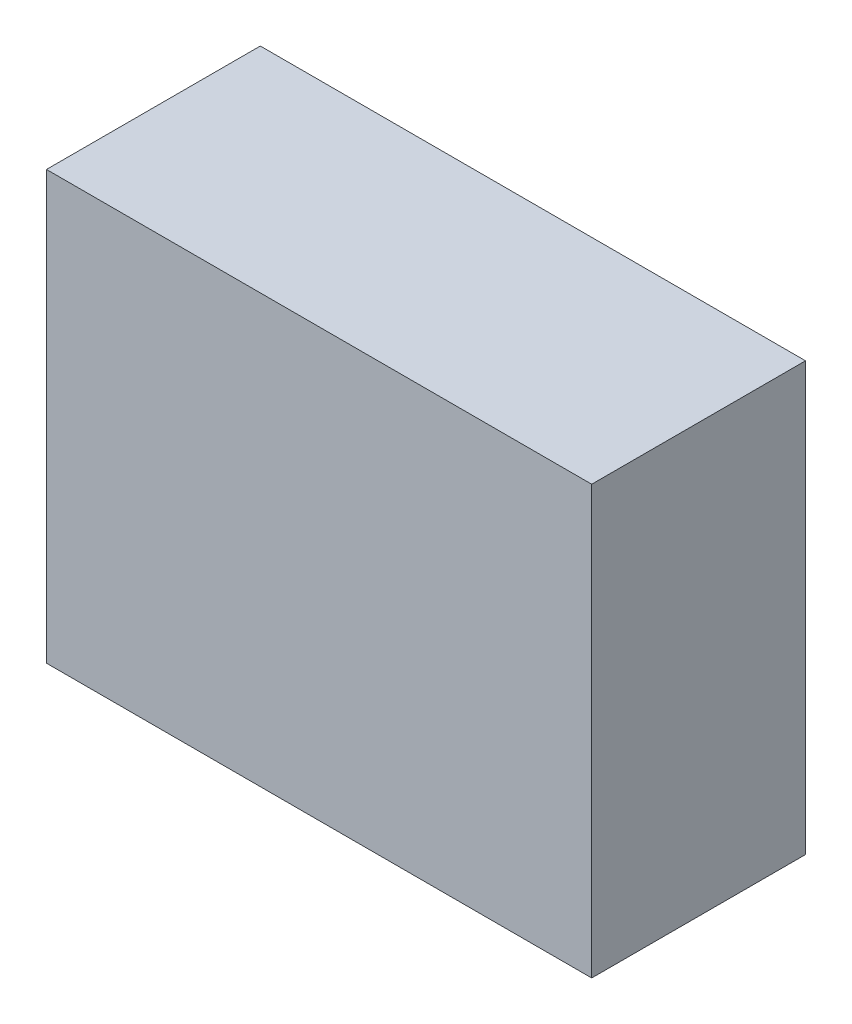
ISO-10303-21;
HEADER;
FILE_DESCRIPTION(('STEP AP214'),'2;1');
FILE_NAME('part.step','',(''),(''),'','','');
FILE_SCHEMA(('AUTOMOTIVE_DESIGN { 1 0 10303 214 1 1 1 1 }'));
ENDSEC;
DATA;
#1=APPLICATION_CONTEXT('core data for automotive mechanical design processes');
#2=APPLICATION_PROTOCOL_DEFINITION('international standard','automotive_design',2000,#1);
#3=PRODUCT_CONTEXT('',#1,'mechanical');
#4=PRODUCT('Part','Part','',(#3));
#5=PRODUCT_RELATED_PRODUCT_CATEGORY('part','',(#4));
#6=PRODUCT_DEFINITION_FORMATION('','',#4);
#7=PRODUCT_DEFINITION_CONTEXT('part definition',#1,'design');
#8=PRODUCT_DEFINITION('design','',#6,#7);
#9=PRODUCT_DEFINITION_SHAPE('','',#8);
#10=(LENGTH_UNIT() NAMED_UNIT(*) SI_UNIT(.MILLI.,.METRE.));
#11=(NAMED_UNIT(*) PLANE_ANGLE_UNIT() SI_UNIT($,.RADIAN.));
#12=(NAMED_UNIT(*) SI_UNIT($,.STERADIAN.) SOLID_ANGLE_UNIT());
#13=UNCERTAINTY_MEASURE_WITH_UNIT(LENGTH_MEASURE(1.E-05),#10,'distance_accuracy_value','');
#14=(GEOMETRIC_REPRESENTATION_CONTEXT(3) GLOBAL_UNCERTAINTY_ASSIGNED_CONTEXT((#13)) GLOBAL_UNIT_ASSIGNED_CONTEXT((#10,
#11,#12)) REPRESENTATION_CONTEXT('',''));
#15=CARTESIAN_POINT('',(0.,0.,0.));
#16=DIRECTION('',(0.,0.,1.));
#17=DIRECTION('',(1.,0.,0.));
#18=AXIS2_PLACEMENT_3D('',#15,#16,#17);
#19=CARTESIAN_POINT('',(0.,0.,20.));
#20=DIRECTION('',(1.,0.,0.));
#21=DIRECTION('',(0.,0.,-1.));
#22=AXIS2_PLACEMENT_3D('',#19,#20,#21);
#23=PLANE('',#22);
#24=DIRECTION('',(0.,-1.,0.));
#25=VECTOR('',#24,1.);
#26=CARTESIAN_POINT('',(0.,0.,0.));
#27=LINE('',#26,#25);
#28=CARTESIAN_POINT('',(0.,40.,0.));
#29=VERTEX_POINT('',#28);
#30=CARTESIAN_POINT('',(0.,0.,0.));
#31=VERTEX_POINT('',#30);
#32=EDGE_CURVE('E96',#29,#31,#27,.T.);
#33=ORIENTED_EDGE('',*,*,#32,.T.);
#34=DIRECTION('',(0.,0.,-1.));
#35=VECTOR('',#34,1.);
#36=CARTESIAN_POINT('',(0.,0.,20.));
#37=LINE('',#36,#35);
#38=CARTESIAN_POINT('',(0.,0.,20.));
#39=VERTEX_POINT('',#38);
#40=EDGE_CURVE('E11',#39,#31,#37,.T.);
#41=ORIENTED_EDGE('',*,*,#40,.F.);
#42=DIRECTION('',(0.,-1.,0.));
#43=VECTOR('',#42,1.);
#44=CARTESIAN_POINT('',(0.,0.,20.));
#45=LINE('',#44,#43);
#46=CARTESIAN_POINT('',(0.,40.,20.));
#47=VERTEX_POINT('',#46);
#48=EDGE_CURVE('E84',#47,#39,#45,.T.);
#49=ORIENTED_EDGE('',*,*,#48,.F.);
#50=DIRECTION('',(0.,0.,-1.));
#51=VECTOR('',#50,1.);
#52=CARTESIAN_POINT('',(0.,40.,20.));
#53=LINE('',#52,#51);
#54=EDGE_CURVE('E92',#47,#29,#53,.T.);
#55=ORIENTED_EDGE('',*,*,#54,.T.);
#56=EDGE_LOOP('',(#33,#41,#49,#55));
#57=FACE_BOUND('',#56,.T.);
#58=ADVANCED_FACE('F33',(#57),#23,.F.);
#59=CARTESIAN_POINT('',(0.,0.,20.));
#60=DIRECTION('',(0.,1.,0.));
#61=DIRECTION('',(0.,0.,1.));
#62=AXIS2_PLACEMENT_3D('',#59,#60,#61);
#63=PLANE('',#62);
#64=DIRECTION('',(1.,0.,0.));
#65=VECTOR('',#64,1.);
#66=CARTESIAN_POINT('',(0.,0.,0.));
#67=LINE('',#66,#65);
#68=CARTESIAN_POINT('',(51.,0.,0.));
#69=VERTEX_POINT('',#68);
#70=EDGE_CURVE('E88',#31,#69,#67,.T.);
#71=ORIENTED_EDGE('',*,*,#70,.T.);
#72=DIRECTION('',(0.,0.,-1.));
#73=VECTOR('',#72,1.);
#74=CARTESIAN_POINT('',(51.,0.,20.));
#75=LINE('',#74,#73);
#76=CARTESIAN_POINT('',(51.,0.,20.));
#77=VERTEX_POINT('',#76);
#78=EDGE_CURVE('E41',#77,#69,#75,.T.);
#79=ORIENTED_EDGE('',*,*,#78,.F.);
#80=DIRECTION('',(1.,0.,0.));
#81=VECTOR('',#80,1.);
#82=CARTESIAN_POINT('',(0.,0.,20.));
#83=LINE('',#82,#81);
#84=EDGE_CURVE('E79',#39,#77,#83,.T.);
#85=ORIENTED_EDGE('',*,*,#84,.F.);
#86=ORIENTED_EDGE('',*,*,#40,.T.);
#87=EDGE_LOOP('',(#71,#79,#85,#86));
#88=FACE_BOUND('',#87,.T.);
#89=ADVANCED_FACE('F87',(#88),#63,.F.);
#90=CARTESIAN_POINT('',(51.,0.,20.));
#91=DIRECTION('',(-1.,0.,0.));
#92=DIRECTION('',(0.,-1.,0.));
#93=AXIS2_PLACEMENT_3D('',#90,#91,#92);
#94=PLANE('',#93);
#95=DIRECTION('',(0.,1.,0.));
#96=VECTOR('',#95,1.);
#97=CARTESIAN_POINT('',(51.,0.,0.));
#98=LINE('',#97,#96);
#99=CARTESIAN_POINT('',(51.,40.,0.));
#100=VERTEX_POINT('',#99);
#101=EDGE_CURVE('E66',#69,#100,#98,.T.);
#102=ORIENTED_EDGE('',*,*,#101,.T.);
#103=DIRECTION('',(0.,0.,-1.));
#104=VECTOR('',#103,1.);
#105=CARTESIAN_POINT('',(51.,40.,20.));
#106=LINE('',#105,#104);
#107=CARTESIAN_POINT('',(51.,40.,20.));
#108=VERTEX_POINT('',#107);
#109=EDGE_CURVE('E89',#108,#100,#106,.T.);
#110=ORIENTED_EDGE('',*,*,#109,.F.);
#111=DIRECTION('',(0.,1.,0.));
#112=VECTOR('',#111,1.);
#113=CARTESIAN_POINT('',(51.,0.,20.));
#114=LINE('',#113,#112);
#115=EDGE_CURVE('E82',#77,#108,#114,.T.);
#116=ORIENTED_EDGE('',*,*,#115,.F.);
#117=ORIENTED_EDGE('',*,*,#78,.T.);
#118=EDGE_LOOP('',(#102,#110,#116,#117));
#119=FACE_BOUND('',#118,.T.);
#120=ADVANCED_FACE('F90',(#119),#94,.F.);
#121=CARTESIAN_POINT('',(0.,40.,20.));
#122=DIRECTION('',(0.,-1.,0.));
#123=DIRECTION('',(0.,0.,-1.));
#124=AXIS2_PLACEMENT_3D('',#121,#122,#123);
#125=PLANE('',#124);
#126=DIRECTION('',(-1.,0.,0.));
#127=VECTOR('',#126,1.);
#128=CARTESIAN_POINT('',(0.,40.,0.));
#129=LINE('',#128,#127);
#130=EDGE_CURVE('E72',#100,#29,#129,.T.);
#131=ORIENTED_EDGE('',*,*,#130,.T.);
#132=ORIENTED_EDGE('',*,*,#54,.F.);
#133=DIRECTION('',(-1.,0.,0.));
#134=VECTOR('',#133,1.);
#135=CARTESIAN_POINT('',(0.,40.,20.));
#136=LINE('',#135,#134);
#137=EDGE_CURVE('E49',#108,#47,#136,.T.);
#138=ORIENTED_EDGE('',*,*,#137,.F.);
#139=ORIENTED_EDGE('',*,*,#109,.T.);
#140=EDGE_LOOP('',(#131,#132,#138,#139));
#141=FACE_BOUND('',#140,.T.);
#142=ADVANCED_FACE('F103',(#141),#125,.F.);
#143=CARTESIAN_POINT('',(0.,40.,20.));
#144=DIRECTION('',(0.,0.,-1.));
#145=DIRECTION('',(-1.,0.,0.));
#146=AXIS2_PLACEMENT_3D('',#143,#144,#145);
#147=PLANE('',#146);
#148=ORIENTED_EDGE('',*,*,#48,.T.);
#149=ORIENTED_EDGE('',*,*,#84,.T.);
#150=ORIENTED_EDGE('',*,*,#115,.T.);
#151=ORIENTED_EDGE('',*,*,#137,.T.);
#152=EDGE_LOOP('',(#148,#149,#150,#151));
#153=FACE_BOUND('',#152,.T.);
#154=ADVANCED_FACE('F80',(#153),#147,.F.);
#155=CARTESIAN_POINT('',(0.,40.,0.));
#156=DIRECTION('',(0.,0.,-1.));
#157=DIRECTION('',(-1.,0.,0.));
#158=AXIS2_PLACEMENT_3D('',#155,#156,#157);
#159=PLANE('',#158);
#160=ORIENTED_EDGE('',*,*,#32,.F.);
#161=ORIENTED_EDGE('',*,*,#130,.F.);
#162=ORIENTED_EDGE('',*,*,#101,.F.);
#163=ORIENTED_EDGE('',*,*,#70,.F.);
#164=EDGE_LOOP('',(#160,#161,#162,#163));
#165=FACE_BOUND('',#164,.T.);
#166=ADVANCED_FACE('F106',(#165),#159,.T.);
#167=CLOSED_SHELL('',(#58,#89,#120,#142,#154,#166));
#168=MANIFOLD_SOLID_BREP('B2',#167);
#169=ADVANCED_BREP_SHAPE_REPRESENTATION('',(#18,#168),#14);
#170=SHAPE_DEFINITION_REPRESENTATION(#9,#169);
ENDSEC;
END-ISO-10303-21;
